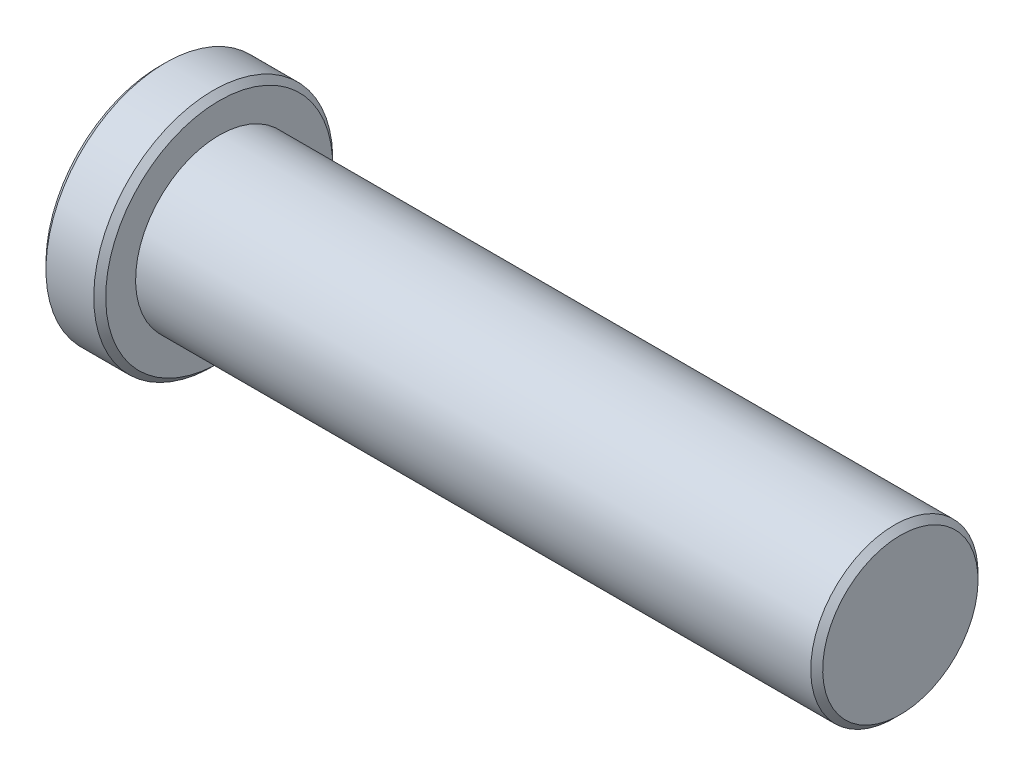
ISO-10303-21;
HEADER;
FILE_DESCRIPTION(('STEP AP214'),'2;1');
FILE_NAME('part.step','',(''),(''),'','','');
FILE_SCHEMA(('AUTOMOTIVE_DESIGN { 1 0 10303 214 1 1 1 1 }'));
ENDSEC;
DATA;
#1=APPLICATION_CONTEXT('core data for automotive mechanical design processes');
#2=APPLICATION_PROTOCOL_DEFINITION('international standard','automotive_design',2000,#1);
#3=PRODUCT_CONTEXT('',#1,'mechanical');
#4=PRODUCT('Part','Part','',(#3));
#5=PRODUCT_RELATED_PRODUCT_CATEGORY('part','',(#4));
#6=PRODUCT_DEFINITION_FORMATION('','',#4);
#7=PRODUCT_DEFINITION_CONTEXT('part definition',#1,'design');
#8=PRODUCT_DEFINITION('design','',#6,#7);
#9=PRODUCT_DEFINITION_SHAPE('','',#8);
#10=(LENGTH_UNIT() NAMED_UNIT(*) SI_UNIT(.MILLI.,.METRE.));
#11=(NAMED_UNIT(*) PLANE_ANGLE_UNIT() SI_UNIT($,.RADIAN.));
#12=(NAMED_UNIT(*) SI_UNIT($,.STERADIAN.) SOLID_ANGLE_UNIT());
#13=UNCERTAINTY_MEASURE_WITH_UNIT(LENGTH_MEASURE(1.E-05),#10,'distance_accuracy_value','');
#14=(GEOMETRIC_REPRESENTATION_CONTEXT(3) GLOBAL_UNCERTAINTY_ASSIGNED_CONTEXT((#13)) GLOBAL_UNIT_ASSIGNED_CONTEXT((#10,
#11,#12)) REPRESENTATION_CONTEXT('',''));
#15=CARTESIAN_POINT('',(0.,0.,0.));
#16=DIRECTION('',(0.,0.,1.));
#17=DIRECTION('',(1.,0.,0.));
#18=AXIS2_PLACEMENT_3D('',#15,#16,#17);
#19=CARTESIAN_POINT('',(0.,0.,0.));
#20=DIRECTION('',(-1.,0.,0.));
#21=DIRECTION('',(0.,-1.,0.));
#22=AXIS2_PLACEMENT_3D('',#19,#20,#21);
#23=PLANE('',#22);
#24=CARTESIAN_POINT('',(0.,0.,0.));
#25=DIRECTION('',(1.,0.,0.));
#26=DIRECTION('',(0.,-1.,0.));
#27=AXIS2_PLACEMENT_3D('',#24,#25,#26);
#28=CIRCLE('',#27,9.49999999999999);
#29=CARTESIAN_POINT('',(0.,-9.49999999999999,0.));
#30=VERTEX_POINT('',#29);
#31=EDGE_CURVE('E10',#30,#30,#28,.T.);
#32=ORIENTED_EDGE('',*,*,#31,.F.);
#33=EDGE_LOOP('',(#32));
#34=FACE_BOUND('',#33,.T.);
#35=ADVANCED_FACE('F37',(#34),#23,.T.);
#36=CARTESIAN_POINT('',(62.,0.,0.));
#37=DIRECTION('',(1.,0.,0.));
#38=DIRECTION('',(0.,1.,0.));
#39=AXIS2_PLACEMENT_3D('',#36,#37,#38);
#40=CYLINDRICAL_SURFACE('',#39,10.);
#41=CARTESIAN_POINT('',(4.5,0.,0.));
#42=DIRECTION('',(-1.,0.,0.));
#43=DIRECTION('',(0.,1.,0.));
#44=AXIS2_PLACEMENT_3D('',#41,#42,#43);
#45=CIRCLE('',#44,10.);
#46=CARTESIAN_POINT('',(4.5,10.,0.));
#47=VERTEX_POINT('',#46);
#48=EDGE_CURVE('E44',#47,#47,#45,.F.);
#49=ORIENTED_EDGE('',*,*,#48,.F.);
#50=EDGE_LOOP('',(#49));
#51=FACE_BOUND('',#50,.T.);
#52=CARTESIAN_POINT('',(0.5,0.,0.));
#53=DIRECTION('',(1.,0.,0.));
#54=DIRECTION('',(0.,-1.,0.));
#55=AXIS2_PLACEMENT_3D('',#52,#53,#54);
#56=CIRCLE('',#55,10.);
#57=CARTESIAN_POINT('',(0.5,-10.,0.));
#58=VERTEX_POINT('',#57);
#59=EDGE_CURVE('E48',#58,#58,#56,.F.);
#60=ORIENTED_EDGE('',*,*,#59,.F.);
#61=EDGE_LOOP('',(#60));
#62=FACE_BOUND('',#61,.T.);
#63=ADVANCED_FACE('F81',(#51,#62),#40,.T.);
#64=CARTESIAN_POINT('',(5.,10.,0.));
#65=DIRECTION('',(1.,0.,0.));
#66=DIRECTION('',(0.,1.,0.));
#67=AXIS2_PLACEMENT_3D('',#64,#65,#66);
#68=PLANE('',#67);
#69=CARTESIAN_POINT('',(5.,0.,0.));
#70=DIRECTION('',(-1.,0.,0.));
#71=DIRECTION('',(0.,1.,0.));
#72=AXIS2_PLACEMENT_3D('',#69,#70,#71);
#73=CIRCLE('',#72,9.49999999999999);
#74=CARTESIAN_POINT('',(5.,9.49999999999999,0.));
#75=VERTEX_POINT('',#74);
#76=EDGE_CURVE('E52',#75,#75,#73,.T.);
#77=ORIENTED_EDGE('',*,*,#76,.F.);
#78=EDGE_LOOP('',(#77));
#79=FACE_BOUND('',#78,.T.);
#80=CARTESIAN_POINT('',(5.,0.,0.));
#81=DIRECTION('',(-1.,0.,0.));
#82=DIRECTION('',(0.,1.,0.));
#83=AXIS2_PLACEMENT_3D('',#80,#81,#82);
#84=CIRCLE('',#83,6.99999999999999);
#85=CARTESIAN_POINT('',(5.,6.99999999999999,0.));
#86=VERTEX_POINT('',#85);
#87=EDGE_CURVE('E63',#86,#86,#84,.T.);
#88=ORIENTED_EDGE('',*,*,#87,.T.);
#89=EDGE_LOOP('',(#88));
#90=FACE_BOUND('',#89,.T.);
#91=ADVANCED_FACE('F67',(#79,#90),#68,.T.);
#92=CARTESIAN_POINT('',(62.,0.,0.));
#93=DIRECTION('',(1.,0.,0.));
#94=DIRECTION('',(0.,1.,0.));
#95=AXIS2_PLACEMENT_3D('',#92,#93,#94);
#96=CYLINDRICAL_SURFACE('',#95,6.99999999999999);
#97=CARTESIAN_POINT('',(61.5,0.,0.));
#98=DIRECTION('',(-1.,0.,0.));
#99=DIRECTION('',(0.,1.,0.));
#100=AXIS2_PLACEMENT_3D('',#97,#98,#99);
#101=CIRCLE('',#100,6.99999999999999);
#102=CARTESIAN_POINT('',(61.5,6.99999999999999,0.));
#103=VERTEX_POINT('',#102);
#104=EDGE_CURVE('E57',#103,#103,#101,.F.);
#105=ORIENTED_EDGE('',*,*,#104,.F.);
#106=EDGE_LOOP('',(#105));
#107=FACE_BOUND('',#106,.T.);
#108=ORIENTED_EDGE('',*,*,#87,.F.);
#109=EDGE_LOOP('',(#108));
#110=FACE_BOUND('',#109,.T.);
#111=ADVANCED_FACE('F69',(#107,#110),#96,.T.);
#112=CARTESIAN_POINT('',(62.,6.99999999999999,0.));
#113=DIRECTION('',(1.,0.,0.));
#114=DIRECTION('',(0.,1.,0.));
#115=AXIS2_PLACEMENT_3D('',#112,#113,#114);
#116=PLANE('',#115);
#117=CARTESIAN_POINT('',(62.,0.,0.));
#118=DIRECTION('',(-1.,0.,0.));
#119=DIRECTION('',(0.,1.,0.));
#120=AXIS2_PLACEMENT_3D('',#117,#118,#119);
#121=CIRCLE('',#120,6.49999999999999);
#122=CARTESIAN_POINT('',(62.,6.49999999999999,0.));
#123=VERTEX_POINT('',#122);
#124=EDGE_CURVE('E60',#123,#123,#121,.T.);
#125=ORIENTED_EDGE('',*,*,#124,.F.);
#126=EDGE_LOOP('',(#125));
#127=FACE_BOUND('',#126,.T.);
#128=ADVANCED_FACE('F71',(#127),#116,.T.);
#129=CARTESIAN_POINT('',(62.,0.,0.));
#130=DIRECTION('',(-1.,0.,0.));
#131=DIRECTION('',(0.,-1.,0.));
#132=AXIS2_PLACEMENT_3D('',#129,#130,#131);
#133=CONICAL_SURFACE('',#132,6.49999999999999,0.785398163397449);
#134=ORIENTED_EDGE('',*,*,#104,.T.);
#135=EDGE_LOOP('',(#134));
#136=FACE_BOUND('',#135,.T.);
#137=ORIENTED_EDGE('',*,*,#124,.T.);
#138=EDGE_LOOP('',(#137));
#139=FACE_BOUND('',#138,.T.);
#140=ADVANCED_FACE('F78',(#136,#139),#133,.T.);
#141=CARTESIAN_POINT('',(5.,0.,0.));
#142=DIRECTION('',(-1.,0.,0.));
#143=DIRECTION('',(0.,-1.,0.));
#144=AXIS2_PLACEMENT_3D('',#141,#142,#143);
#145=CONICAL_SURFACE('',#144,9.49999999999999,0.78539816339745);
#146=ORIENTED_EDGE('',*,*,#48,.T.);
#147=EDGE_LOOP('',(#146));
#148=FACE_BOUND('',#147,.T.);
#149=ORIENTED_EDGE('',*,*,#76,.T.);
#150=EDGE_LOOP('',(#149));
#151=FACE_BOUND('',#150,.T.);
#152=ADVANCED_FACE('F95',(#148,#151),#145,.T.);
#153=CARTESIAN_POINT('',(0.5,0.,0.));
#154=DIRECTION('',(1.,0.,0.));
#155=DIRECTION('',(0.,1.,0.));
#156=AXIS2_PLACEMENT_3D('',#153,#154,#155);
#157=CONICAL_SURFACE('',#156,10.,0.78539816339745);
#158=ORIENTED_EDGE('',*,*,#31,.T.);
#159=EDGE_LOOP('',(#158));
#160=FACE_BOUND('',#159,.T.);
#161=ORIENTED_EDGE('',*,*,#59,.T.);
#162=EDGE_LOOP('',(#161));
#163=FACE_BOUND('',#162,.T.);
#164=ADVANCED_FACE('F39',(#160,#163),#157,.T.);
#165=CLOSED_SHELL('',(#35,#63,#91,#111,#128,#140,#152,#164));
#166=MANIFOLD_SOLID_BREP('B2',#165);
#167=ADVANCED_BREP_SHAPE_REPRESENTATION('',(#18,#166),#14);
#168=SHAPE_DEFINITION_REPRESENTATION(#9,#167);
ENDSEC;
END-ISO-10303-21;
